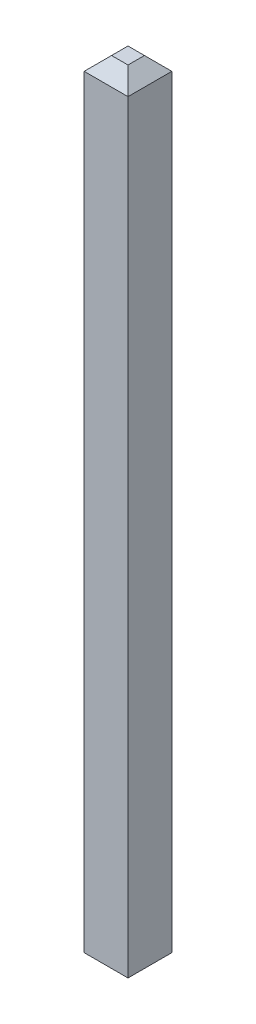
ISO-10303-21;
HEADER;
FILE_DESCRIPTION(('STEP AP214'),'2;1');
FILE_NAME('part.step','',(''),(''),'','','');
FILE_SCHEMA(('AUTOMOTIVE_DESIGN { 1 0 10303 214 1 1 1 1 }'));
ENDSEC;
DATA;
#1=APPLICATION_CONTEXT('core data for automotive mechanical design processes');
#2=APPLICATION_PROTOCOL_DEFINITION('international standard','automotive_design',2000,#1);
#3=PRODUCT_CONTEXT('',#1,'mechanical');
#4=PRODUCT('Part','Part','',(#3));
#5=PRODUCT_RELATED_PRODUCT_CATEGORY('part','',(#4));
#6=PRODUCT_DEFINITION_FORMATION('','',#4);
#7=PRODUCT_DEFINITION_CONTEXT('part definition',#1,'design');
#8=PRODUCT_DEFINITION('design','',#6,#7);
#9=PRODUCT_DEFINITION_SHAPE('','',#8);
#10=(LENGTH_UNIT() NAMED_UNIT(*) SI_UNIT(.MILLI.,.METRE.));
#11=(NAMED_UNIT(*) PLANE_ANGLE_UNIT() SI_UNIT($,.RADIAN.));
#12=(NAMED_UNIT(*) SI_UNIT($,.STERADIAN.) SOLID_ANGLE_UNIT());
#13=UNCERTAINTY_MEASURE_WITH_UNIT(LENGTH_MEASURE(1.E-05),#10,'distance_accuracy_value','');
#14=(GEOMETRIC_REPRESENTATION_CONTEXT(3) GLOBAL_UNCERTAINTY_ASSIGNED_CONTEXT((#13)) GLOBAL_UNIT_ASSIGNED_CONTEXT((#10,
#11,#12)) REPRESENTATION_CONTEXT('',''));
#15=CARTESIAN_POINT('',(0.,0.,0.));
#16=DIRECTION('',(0.,0.,1.));
#17=DIRECTION('',(1.,0.,0.));
#18=AXIS2_PLACEMENT_3D('',#15,#16,#17);
#19=CARTESIAN_POINT('',(6.67,7.07,-0.32));
#20=DIRECTION('',(-0.707106781186548,-0.707106781186548,0.));
#21=DIRECTION('',(-0.707106781186548,0.707106781186548,0.));
#22=AXIS2_PLACEMENT_3D('',#19,#20,#21);
#23=PLANE('',#22);
#24=DIRECTION('',(0.577350269189626,-0.577350269189626,0.577350269189626));
#25=VECTOR('',#24,1.);
#26=CARTESIAN_POINT('',(6.456666666667,7.283333333333,0.106666666667));
#27=LINE('',#26,#25);
#28=CARTESIAN_POINT('',(6.47,7.27,0.12));
#29=VERTEX_POINT('',#28);
#30=CARTESIAN_POINT('',(6.67,7.07,0.32));
#31=VERTEX_POINT('',#30);
#32=EDGE_CURVE('E105',#29,#31,#27,.T.);
#33=ORIENTED_EDGE('',*,*,#32,.T.);
#34=DIRECTION('',(0.,0.,1.));
#35=VECTOR('',#34,1.);
#36=CARTESIAN_POINT('',(6.67,7.07,-0.32));
#37=LINE('',#36,#35);
#38=CARTESIAN_POINT('',(6.67,7.07,-0.32));
#39=VERTEX_POINT('',#38);
#40=EDGE_CURVE('E312',#39,#31,#37,.T.);
#41=ORIENTED_EDGE('',*,*,#40,.F.);
#42=DIRECTION('',(0.577350269189626,-0.577350269189626,-0.577350269189626));
#43=VECTOR('',#42,1.);
#44=CARTESIAN_POINT('',(6.67,7.07,-0.32));
#45=LINE('',#44,#43);
#46=CARTESIAN_POINT('',(6.47,7.27,-0.12));
#47=VERTEX_POINT('',#46);
#48=EDGE_CURVE('E11',#47,#39,#45,.T.);
#49=ORIENTED_EDGE('',*,*,#48,.F.);
#50=DIRECTION('',(0.,0.,-1.));
#51=VECTOR('',#50,1.);
#52=CARTESIAN_POINT('',(6.47,7.27,-0.32));
#53=LINE('',#52,#51);
#54=EDGE_CURVE('E325',#29,#47,#53,.T.);
#55=ORIENTED_EDGE('',*,*,#54,.F.);
#56=EDGE_LOOP('',(#33,#41,#49,#55));
#57=FACE_BOUND('',#56,.T.);
#58=ADVANCED_FACE('F16',(#57),#23,.F.);
#59=CARTESIAN_POINT('',(6.35,7.07,-0.32));
#60=DIRECTION('',(0.,0.707106781186548,-0.707106781186548));
#61=DIRECTION('',(-1.,0.,0.));
#62=AXIS2_PLACEMENT_3D('',#59,#60,#61);
#63=PLANE('',#62);
#64=DIRECTION('',(0.577350269189626,0.577350269189626,0.577350269189626));
#65=VECTOR('',#64,1.);
#66=CARTESIAN_POINT('',(6.163333333333,7.203333333333,-0.186666666667));
#67=LINE('',#66,#65);
#68=CARTESIAN_POINT('',(6.03,7.07,-0.32));
#69=VERTEX_POINT('',#68);
#70=CARTESIAN_POINT('',(6.23,7.27,-0.12));
#71=VERTEX_POINT('',#70);
#72=EDGE_CURVE('E27',#69,#71,#67,.T.);
#73=ORIENTED_EDGE('',*,*,#72,.T.);
#74=DIRECTION('',(-1.,0.,0.));
#75=VECTOR('',#74,1.);
#76=CARTESIAN_POINT('',(6.03,7.27,-0.12));
#77=LINE('',#76,#75);
#78=EDGE_CURVE('E328',#47,#71,#77,.T.);
#79=ORIENTED_EDGE('',*,*,#78,.F.);
#80=ORIENTED_EDGE('',*,*,#48,.T.);
#81=DIRECTION('',(1.,0.,0.));
#82=VECTOR('',#81,1.);
#83=CARTESIAN_POINT('',(6.67,7.07,-0.32));
#84=LINE('',#83,#82);
#85=EDGE_CURVE('E167',#69,#39,#84,.T.);
#86=ORIENTED_EDGE('',*,*,#85,.F.);
#87=EDGE_LOOP('',(#73,#79,#80,#86));
#88=FACE_BOUND('',#87,.T.);
#89=ADVANCED_FACE('F194',(#88),#63,.T.);
#90=CARTESIAN_POINT('',(6.23,7.27,-0.32));
#91=DIRECTION('',(0.707106781186548,-0.707106781186548,0.));
#92=DIRECTION('',(0.,0.,-1.));
#93=AXIS2_PLACEMENT_3D('',#90,#91,#92);
#94=PLANE('',#93);
#95=DIRECTION('',(-0.577350269189626,-0.577350269189626,0.577350269189626));
#96=VECTOR('',#95,1.);
#97=CARTESIAN_POINT('',(6.163333333333,7.203333333333,0.186666666667));
#98=LINE('',#97,#96);
#99=CARTESIAN_POINT('',(6.23,7.27,0.12));
#100=VERTEX_POINT('',#99);
#101=CARTESIAN_POINT('',(6.03,7.07,0.32));
#102=VERTEX_POINT('',#101);
#103=EDGE_CURVE('E41',#100,#102,#98,.T.);
#104=ORIENTED_EDGE('',*,*,#103,.F.);
#105=DIRECTION('',(0.,0.,1.));
#106=VECTOR('',#105,1.);
#107=CARTESIAN_POINT('',(6.23,7.27,-0.32));
#108=LINE('',#107,#106);
#109=EDGE_CURVE('E184',#71,#100,#108,.T.);
#110=ORIENTED_EDGE('',*,*,#109,.F.);
#111=ORIENTED_EDGE('',*,*,#72,.F.);
#112=DIRECTION('',(0.,0.,-1.));
#113=VECTOR('',#112,1.);
#114=CARTESIAN_POINT('',(6.03,7.07,-0.32));
#115=LINE('',#114,#113);
#116=EDGE_CURVE('E172',#102,#69,#115,.T.);
#117=ORIENTED_EDGE('',*,*,#116,.F.);
#118=EDGE_LOOP('',(#104,#110,#111,#117));
#119=FACE_BOUND('',#118,.T.);
#120=ADVANCED_FACE('F198',(#119),#94,.F.);
#121=CARTESIAN_POINT('',(6.03,7.27,0.12));
#122=DIRECTION('',(0.,-0.707106781186548,-0.707106781186548));
#123=DIRECTION('',(0.,-0.707106781186548,0.707106781186548));
#124=AXIS2_PLACEMENT_3D('',#121,#122,#123);
#125=PLANE('',#124);
#126=ORIENTED_EDGE('',*,*,#32,.F.);
#127=DIRECTION('',(1.,0.,0.));
#128=VECTOR('',#127,1.);
#129=CARTESIAN_POINT('',(6.03,7.27,0.12));
#130=LINE('',#129,#128);
#131=EDGE_CURVE('E20',#100,#29,#130,.T.);
#132=ORIENTED_EDGE('',*,*,#131,.F.);
#133=ORIENTED_EDGE('',*,*,#103,.T.);
#134=DIRECTION('',(-1.,0.,0.));
#135=VECTOR('',#134,1.);
#136=CARTESIAN_POINT('',(6.35,7.07,0.32));
#137=LINE('',#136,#135);
#138=EDGE_CURVE('E306',#31,#102,#137,.T.);
#139=ORIENTED_EDGE('',*,*,#138,.F.);
#140=EDGE_LOOP('',(#126,#132,#133,#139));
#141=FACE_BOUND('',#140,.T.);
#142=ADVANCED_FACE('F219',(#141),#125,.F.);
#143=CARTESIAN_POINT('',(6.03,7.27,-0.32));
#144=DIRECTION('',(0.,-1.,0.));
#145=DIRECTION('',(0.,0.,-1.));
#146=AXIS2_PLACEMENT_3D('',#143,#144,#145);
#147=PLANE('',#146);
#148=ORIENTED_EDGE('',*,*,#54,.T.);
#149=ORIENTED_EDGE('',*,*,#78,.T.);
#150=ORIENTED_EDGE('',*,*,#109,.T.);
#151=ORIENTED_EDGE('',*,*,#131,.T.);
#152=EDGE_LOOP('',(#148,#149,#150,#151));
#153=FACE_BOUND('',#152,.T.);
#154=ADVANCED_FACE('F214',(#153),#147,.F.);
#155=CARTESIAN_POINT('',(6.67,7.27,-0.32));
#156=DIRECTION('',(-1.,0.,0.));
#157=DIRECTION('',(0.,1.,0.));
#158=AXIS2_PLACEMENT_3D('',#155,#156,#157);
#159=PLANE('',#158);
#160=DIRECTION('',(0.,-1.,0.));
#161=VECTOR('',#160,1.);
#162=CARTESIAN_POINT('',(6.67,7.27,-0.32));
#163=LINE('',#162,#161);
#164=CARTESIAN_POINT('',(6.67,-4.07,-0.32));
#165=VERTEX_POINT('',#164);
#166=EDGE_CURVE('E171',#39,#165,#163,.T.);
#167=ORIENTED_EDGE('',*,*,#166,.F.);
#168=ORIENTED_EDGE('',*,*,#40,.T.);
#169=DIRECTION('',(0.,-1.,0.));
#170=VECTOR('',#169,1.);
#171=CARTESIAN_POINT('',(6.67,7.27,0.32));
#172=LINE('',#171,#170);
#173=CARTESIAN_POINT('',(6.67,-4.07,0.32));
#174=VERTEX_POINT('',#173);
#175=EDGE_CURVE('E166',#31,#174,#172,.T.);
#176=ORIENTED_EDGE('',*,*,#175,.T.);
#177=DIRECTION('',(0.,0.,-1.));
#178=VECTOR('',#177,1.);
#179=CARTESIAN_POINT('',(6.67,-4.07,-0.32));
#180=LINE('',#179,#178);
#181=EDGE_CURVE('E163',#174,#165,#180,.T.);
#182=ORIENTED_EDGE('',*,*,#181,.T.);
#183=EDGE_LOOP('',(#167,#168,#176,#182));
#184=FACE_BOUND('',#183,.T.);
#185=ADVANCED_FACE('F218',(#184),#159,.F.);
#186=CARTESIAN_POINT('',(6.35,1.5,0.32));
#187=DIRECTION('',(0.,0.,-1.));
#188=DIRECTION('',(0.,-1.,0.));
#189=AXIS2_PLACEMENT_3D('',#186,#187,#188);
#190=PLANE('',#189);
#191=ORIENTED_EDGE('',*,*,#175,.F.);
#192=ORIENTED_EDGE('',*,*,#138,.T.);
#193=DIRECTION('',(0.,1.,0.));
#194=VECTOR('',#193,1.);
#195=CARTESIAN_POINT('',(6.03,-4.27,0.32));
#196=LINE('',#195,#194);
#197=CARTESIAN_POINT('',(6.03,-4.07,0.32));
#198=VERTEX_POINT('',#197);
#199=EDGE_CURVE('E175',#198,#102,#196,.T.);
#200=ORIENTED_EDGE('',*,*,#199,.F.);
#201=DIRECTION('',(1.,0.,0.));
#202=VECTOR('',#201,1.);
#203=CARTESIAN_POINT('',(6.35,-4.07,0.32));
#204=LINE('',#203,#202);
#205=EDGE_CURVE('E159',#198,#174,#204,.T.);
#206=ORIENTED_EDGE('',*,*,#205,.T.);
#207=EDGE_LOOP('',(#191,#192,#200,#206));
#208=FACE_BOUND('',#207,.T.);
#209=ADVANCED_FACE('F240',(#208),#190,.F.);
#210=CARTESIAN_POINT('',(6.47,-4.27,-0.32));
#211=DIRECTION('',(-0.707106781186548,0.707106781186548,0.));
#212=DIRECTION('',(0.,0.,1.));
#213=AXIS2_PLACEMENT_3D('',#210,#211,#212);
#214=PLANE('',#213);
#215=DIRECTION('',(-0.577350269189626,-0.577350269189626,0.577350269189626));
#216=VECTOR('',#215,1.);
#217=CARTESIAN_POINT('',(6.536666666667,-4.203333333333,-0.186666666667));
#218=LINE('',#217,#216);
#219=CARTESIAN_POINT('',(6.47,-4.27,-0.12));
#220=VERTEX_POINT('',#219);
#221=EDGE_CURVE('E119',#165,#220,#218,.T.);
#222=ORIENTED_EDGE('',*,*,#221,.F.);
#223=ORIENTED_EDGE('',*,*,#181,.F.);
#224=DIRECTION('',(-0.577350269189626,-0.577350269189626,-0.577350269189626));
#225=VECTOR('',#224,1.);
#226=CARTESIAN_POINT('',(6.323333333333,-4.416666666667,-0.02666666666667));
#227=LINE('',#226,#225);
#228=CARTESIAN_POINT('',(6.47,-4.27,0.12));
#229=VERTEX_POINT('',#228);
#230=EDGE_CURVE('E142',#174,#229,#227,.T.);
#231=ORIENTED_EDGE('',*,*,#230,.T.);
#232=DIRECTION('',(0.,0.,1.));
#233=VECTOR('',#232,1.);
#234=CARTESIAN_POINT('',(6.47,-4.27,-0.32));
#235=LINE('',#234,#233);
#236=EDGE_CURVE('E136',#220,#229,#235,.T.);
#237=ORIENTED_EDGE('',*,*,#236,.F.);
#238=EDGE_LOOP('',(#222,#223,#231,#237));
#239=FACE_BOUND('',#238,.T.);
#240=ADVANCED_FACE('F140',(#239),#214,.F.);
#241=CARTESIAN_POINT('',(6.67,-4.27,0.12));
#242=DIRECTION('',(0.,0.707106781186548,-0.707106781186548));
#243=DIRECTION('',(-1.,0.,0.));
#244=AXIS2_PLACEMENT_3D('',#241,#242,#243);
#245=PLANE('',#244);
#246=ORIENTED_EDGE('',*,*,#230,.F.);
#247=ORIENTED_EDGE('',*,*,#205,.F.);
#248=DIRECTION('',(-0.577350269189626,0.577350269189626,0.577350269189626));
#249=VECTOR('',#248,1.);
#250=CARTESIAN_POINT('',(6.243333333333,-4.283333333333,0.106666666667));
#251=LINE('',#250,#249);
#252=CARTESIAN_POINT('',(6.23,-4.27,0.12));
#253=VERTEX_POINT('',#252);
#254=EDGE_CURVE('E155',#253,#198,#251,.T.);
#255=ORIENTED_EDGE('',*,*,#254,.F.);
#256=DIRECTION('',(-1.,0.,0.));
#257=VECTOR('',#256,1.);
#258=CARTESIAN_POINT('',(6.67,-4.27,0.12));
#259=LINE('',#258,#257);
#260=EDGE_CURVE('E145',#229,#253,#259,.T.);
#261=ORIENTED_EDGE('',*,*,#260,.F.);
#262=EDGE_LOOP('',(#246,#247,#255,#261));
#263=FACE_BOUND('',#262,.T.);
#264=ADVANCED_FACE('F209',(#263),#245,.F.);
#265=CARTESIAN_POINT('',(6.03,-4.07,-0.32));
#266=DIRECTION('',(0.707106781186548,0.707106781186548,0.));
#267=DIRECTION('',(0.,0.,-1.));
#268=AXIS2_PLACEMENT_3D('',#265,#266,#267);
#269=PLANE('',#268);
#270=DIRECTION('',(0.577350269189626,-0.577350269189626,0.577350269189626));
#271=VECTOR('',#270,1.);
#272=CARTESIAN_POINT('',(6.136666666667,-4.176666666667,-0.213333333333));
#273=LINE('',#272,#271);
#274=CARTESIAN_POINT('',(6.03,-4.07,-0.32));
#275=VERTEX_POINT('',#274);
#276=CARTESIAN_POINT('',(6.23,-4.27,-0.12));
#277=VERTEX_POINT('',#276);
#278=EDGE_CURVE('E73',#275,#277,#273,.T.);
#279=ORIENTED_EDGE('',*,*,#278,.T.);
#280=DIRECTION('',(0.,0.,-1.));
#281=VECTOR('',#280,1.);
#282=CARTESIAN_POINT('',(6.23,-4.27,-0.32));
#283=LINE('',#282,#281);
#284=EDGE_CURVE('E137',#253,#277,#283,.T.);
#285=ORIENTED_EDGE('',*,*,#284,.F.);
#286=ORIENTED_EDGE('',*,*,#254,.T.);
#287=DIRECTION('',(0.,0.,1.));
#288=VECTOR('',#287,1.);
#289=CARTESIAN_POINT('',(6.03,-4.07,-0.32));
#290=LINE('',#289,#288);
#291=EDGE_CURVE('E82',#275,#198,#290,.T.);
#292=ORIENTED_EDGE('',*,*,#291,.F.);
#293=EDGE_LOOP('',(#279,#285,#286,#292));
#294=FACE_BOUND('',#293,.T.);
#295=ADVANCED_FACE('F204',(#294),#269,.F.);
#296=CARTESIAN_POINT('',(6.03,-4.27,-0.32));
#297=DIRECTION('',(1.,0.,0.));
#298=DIRECTION('',(0.,0.,1.));
#299=AXIS2_PLACEMENT_3D('',#296,#297,#298);
#300=PLANE('',#299);
#301=ORIENTED_EDGE('',*,*,#199,.T.);
#302=ORIENTED_EDGE('',*,*,#116,.T.);
#303=DIRECTION('',(0.,1.,0.));
#304=VECTOR('',#303,1.);
#305=CARTESIAN_POINT('',(6.03,-4.27,-0.32));
#306=LINE('',#305,#304);
#307=EDGE_CURVE('E130',#275,#69,#306,.T.);
#308=ORIENTED_EDGE('',*,*,#307,.F.);
#309=ORIENTED_EDGE('',*,*,#291,.T.);
#310=EDGE_LOOP('',(#301,#302,#308,#309));
#311=FACE_BOUND('',#310,.T.);
#312=ADVANCED_FACE('F208',(#311),#300,.F.);
#313=CARTESIAN_POINT('',(6.35,1.5,-0.32));
#314=DIRECTION('',(0.,0.,-1.));
#315=DIRECTION('',(0.,-1.,0.));
#316=AXIS2_PLACEMENT_3D('',#313,#314,#315);
#317=PLANE('',#316);
#318=ORIENTED_EDGE('',*,*,#307,.T.);
#319=ORIENTED_EDGE('',*,*,#85,.T.);
#320=ORIENTED_EDGE('',*,*,#166,.T.);
#321=DIRECTION('',(-1.,0.,0.));
#322=VECTOR('',#321,1.);
#323=CARTESIAN_POINT('',(6.03,-4.07,-0.32));
#324=LINE('',#323,#322);
#325=EDGE_CURVE('E125',#165,#275,#324,.T.);
#326=ORIENTED_EDGE('',*,*,#325,.T.);
#327=EDGE_LOOP('',(#318,#319,#320,#326));
#328=FACE_BOUND('',#327,.T.);
#329=ADVANCED_FACE('F18',(#328),#317,.T.);
#330=CARTESIAN_POINT('',(6.35,-4.07,-0.32));
#331=DIRECTION('',(0.,-0.707106781186548,-0.707106781186548));
#332=DIRECTION('',(0.,-0.707106781186548,0.707106781186548));
#333=AXIS2_PLACEMENT_3D('',#330,#331,#332);
#334=PLANE('',#333);
#335=ORIENTED_EDGE('',*,*,#278,.F.);
#336=ORIENTED_EDGE('',*,*,#325,.F.);
#337=ORIENTED_EDGE('',*,*,#221,.T.);
#338=DIRECTION('',(1.,0.,0.));
#339=VECTOR('',#338,1.);
#340=CARTESIAN_POINT('',(6.67,-4.27,-0.12));
#341=LINE('',#340,#339);
#342=EDGE_CURVE('E122',#277,#220,#341,.T.);
#343=ORIENTED_EDGE('',*,*,#342,.F.);
#344=EDGE_LOOP('',(#335,#336,#337,#343));
#345=FACE_BOUND('',#344,.T.);
#346=ADVANCED_FACE('F121',(#345),#334,.T.);
#347=CARTESIAN_POINT('',(6.67,-4.27,-0.32));
#348=DIRECTION('',(0.,1.,0.));
#349=DIRECTION('',(0.,0.,-1.));
#350=AXIS2_PLACEMENT_3D('',#347,#348,#349);
#351=PLANE('',#350);
#352=ORIENTED_EDGE('',*,*,#236,.T.);
#353=ORIENTED_EDGE('',*,*,#260,.T.);
#354=ORIENTED_EDGE('',*,*,#284,.T.);
#355=ORIENTED_EDGE('',*,*,#342,.T.);
#356=EDGE_LOOP('',(#352,#353,#354,#355));
#357=FACE_BOUND('',#356,.T.);
#358=ADVANCED_FACE('F134',(#357),#351,.F.);
#359=CLOSED_SHELL('',(#58,#89,#120,#142,#154,#185,#209,#240,#264,#295,#312,#329,#346,#358));
#360=MANIFOLD_SOLID_BREP('B1',#359);
#361=ADVANCED_BREP_SHAPE_REPRESENTATION('',(#18,#360),#14);
#362=SHAPE_DEFINITION_REPRESENTATION(#9,#361);
ENDSEC;
END-ISO-10303-21;
